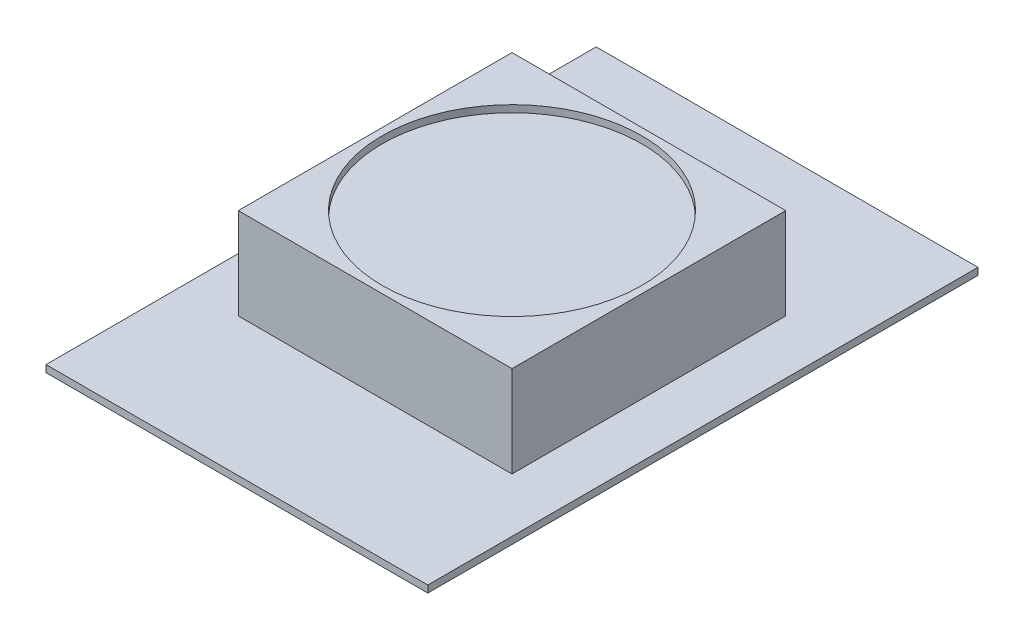
ISO-10303-21;
HEADER;
FILE_DESCRIPTION(('STEP AP214'),'2;1');
FILE_NAME('part.step','',(''),(''),'','','');
FILE_SCHEMA(('AUTOMOTIVE_DESIGN { 1 0 10303 214 1 1 1 1 }'));
ENDSEC;
DATA;
#1=APPLICATION_CONTEXT('core data for automotive mechanical design processes');
#2=APPLICATION_PROTOCOL_DEFINITION('international standard','automotive_design',2000,#1);
#3=PRODUCT_CONTEXT('',#1,'mechanical');
#4=PRODUCT('Part','Part','',(#3));
#5=PRODUCT_RELATED_PRODUCT_CATEGORY('part','',(#4));
#6=PRODUCT_DEFINITION_FORMATION('','',#4);
#7=PRODUCT_DEFINITION_CONTEXT('part definition',#1,'design');
#8=PRODUCT_DEFINITION('design','',#6,#7);
#9=PRODUCT_DEFINITION_SHAPE('','',#8);
#10=(LENGTH_UNIT() NAMED_UNIT(*) SI_UNIT(.MILLI.,.METRE.));
#11=(NAMED_UNIT(*) PLANE_ANGLE_UNIT() SI_UNIT($,.RADIAN.));
#12=(NAMED_UNIT(*) SI_UNIT($,.STERADIAN.) SOLID_ANGLE_UNIT());
#13=UNCERTAINTY_MEASURE_WITH_UNIT(LENGTH_MEASURE(1.E-05),#10,'distance_accuracy_value','');
#14=(GEOMETRIC_REPRESENTATION_CONTEXT(3) GLOBAL_UNCERTAINTY_ASSIGNED_CONTEXT((#13)) GLOBAL_UNIT_ASSIGNED_CONTEXT((#10,
#11,#12)) REPRESENTATION_CONTEXT('',''));
#15=CARTESIAN_POINT('',(0.,0.,0.));
#16=DIRECTION('',(0.,0.,1.));
#17=DIRECTION('',(1.,0.,0.));
#18=AXIS2_PLACEMENT_3D('',#15,#16,#17);
#19=CARTESIAN_POINT('',(0.,0.127,0.));
#20=DIRECTION('',(0.,1.,0.));
#21=DIRECTION('',(0.,0.,1.));
#22=AXIS2_PLACEMENT_3D('',#19,#20,#21);
#23=PLANE('',#22);
#24=DIRECTION('',(0.,0.,1.));
#25=VECTOR('',#24,1.);
#26=CARTESIAN_POINT('',(-3.4544,0.127,-4.9784));
#27=LINE('',#26,#25);
#28=CARTESIAN_POINT('',(-3.4544,0.127,-4.9784));
#29=VERTEX_POINT('',#28);
#30=CARTESIAN_POINT('',(-3.4544,0.127,4.9784));
#31=VERTEX_POINT('',#30);
#32=EDGE_CURVE('E140',#29,#31,#27,.T.);
#33=ORIENTED_EDGE('',*,*,#32,.T.);
#34=DIRECTION('',(1.,0.,0.));
#35=VECTOR('',#34,1.);
#36=CARTESIAN_POINT('',(-3.4544,0.127,4.9784));
#37=LINE('',#36,#35);
#38=CARTESIAN_POINT('',(3.4544,0.127,4.9784));
#39=VERTEX_POINT('',#38);
#40=EDGE_CURVE('E85',#31,#39,#37,.T.);
#41=ORIENTED_EDGE('',*,*,#40,.T.);
#42=DIRECTION('',(0.,0.,-1.));
#43=VECTOR('',#42,1.);
#44=CARTESIAN_POINT('',(3.4544,0.127,-4.9784));
#45=LINE('',#44,#43);
#46=CARTESIAN_POINT('',(3.4544,0.127,-4.9784));
#47=VERTEX_POINT('',#46);
#48=EDGE_CURVE('E143',#39,#47,#45,.T.);
#49=ORIENTED_EDGE('',*,*,#48,.T.);
#50=DIRECTION('',(-1.,0.,0.));
#51=VECTOR('',#50,1.);
#52=CARTESIAN_POINT('',(-3.4544,0.127,-4.9784));
#53=LINE('',#52,#51);
#54=EDGE_CURVE('E57',#47,#29,#53,.T.);
#55=ORIENTED_EDGE('',*,*,#54,.T.);
#56=EDGE_LOOP('',(#33,#41,#49,#55));
#57=FACE_BOUND('',#56,.T.);
#58=DIRECTION('',(1.,0.,0.));
#59=VECTOR('',#58,1.);
#60=CARTESIAN_POINT('',(-2.4765,0.127,2.4765));
#61=LINE('',#60,#59);
#62=CARTESIAN_POINT('',(-2.4765,0.127,2.4765));
#63=VERTEX_POINT('',#62);
#64=CARTESIAN_POINT('',(2.4765,0.127,2.4765));
#65=VERTEX_POINT('',#64);
#66=EDGE_CURVE('E210',#63,#65,#61,.T.);
#67=ORIENTED_EDGE('',*,*,#66,.F.);
#68=DIRECTION('',(0.,0.,1.));
#69=VECTOR('',#68,1.);
#70=CARTESIAN_POINT('',(-2.4765,0.127,-2.4765));
#71=LINE('',#70,#69);
#72=CARTESIAN_POINT('',(-2.4765,0.127,-2.4765));
#73=VERTEX_POINT('',#72);
#74=EDGE_CURVE('E130',#73,#63,#71,.T.);
#75=ORIENTED_EDGE('',*,*,#74,.F.);
#76=DIRECTION('',(-1.,0.,0.));
#77=VECTOR('',#76,1.);
#78=CARTESIAN_POINT('',(-2.4765,0.127,-2.4765));
#79=LINE('',#78,#77);
#80=CARTESIAN_POINT('',(2.4765,0.127,-2.4765));
#81=VERTEX_POINT('',#80);
#82=EDGE_CURVE('E126',#81,#73,#79,.T.);
#83=ORIENTED_EDGE('',*,*,#82,.F.);
#84=DIRECTION('',(0.,0.,-1.));
#85=VECTOR('',#84,1.);
#86=CARTESIAN_POINT('',(2.4765,0.127,-2.4765));
#87=LINE('',#86,#85);
#88=EDGE_CURVE('E219',#65,#81,#87,.T.);
#89=ORIENTED_EDGE('',*,*,#88,.F.);
#90=EDGE_LOOP('',(#67,#75,#83,#89));
#91=FACE_BOUND('',#90,.T.);
#92=ADVANCED_FACE('F33',(#57,#91),#23,.T.);
#93=CARTESIAN_POINT('',(-3.4544,0.127,-4.9784));
#94=DIRECTION('',(1.,0.,0.));
#95=DIRECTION('',(0.,0.,-1.));
#96=AXIS2_PLACEMENT_3D('',#93,#94,#95);
#97=PLANE('',#96);
#98=DIRECTION('',(0.,0.,1.));
#99=VECTOR('',#98,1.);
#100=CARTESIAN_POINT('',(-3.4544,0.,-4.9784));
#101=LINE('',#100,#99);
#102=CARTESIAN_POINT('',(-3.4544,0.,-4.9784));
#103=VERTEX_POINT('',#102);
#104=CARTESIAN_POINT('',(-3.4544,0.,4.9784));
#105=VERTEX_POINT('',#104);
#106=EDGE_CURVE('E132',#103,#105,#101,.T.);
#107=ORIENTED_EDGE('',*,*,#106,.T.);
#108=DIRECTION('',(0.,-1.,0.));
#109=VECTOR('',#108,1.);
#110=CARTESIAN_POINT('',(-3.4544,0.127,4.9784));
#111=LINE('',#110,#109);
#112=EDGE_CURVE('E11',#31,#105,#111,.T.);
#113=ORIENTED_EDGE('',*,*,#112,.F.);
#114=ORIENTED_EDGE('',*,*,#32,.F.);
#115=DIRECTION('',(0.,-1.,0.));
#116=VECTOR('',#115,1.);
#117=CARTESIAN_POINT('',(-3.4544,0.127,-4.9784));
#118=LINE('',#117,#116);
#119=EDGE_CURVE('E145',#29,#103,#118,.T.);
#120=ORIENTED_EDGE('',*,*,#119,.T.);
#121=EDGE_LOOP('',(#107,#113,#114,#120));
#122=FACE_BOUND('',#121,.T.);
#123=ADVANCED_FACE('F35',(#122),#97,.F.);
#124=CARTESIAN_POINT('',(-3.4544,0.127,4.9784));
#125=DIRECTION('',(0.,0.,-1.));
#126=DIRECTION('',(-1.,0.,0.));
#127=AXIS2_PLACEMENT_3D('',#124,#125,#126);
#128=PLANE('',#127);
#129=DIRECTION('',(1.,0.,0.));
#130=VECTOR('',#129,1.);
#131=CARTESIAN_POINT('',(-3.4544,0.,4.9784));
#132=LINE('',#131,#130);
#133=CARTESIAN_POINT('',(3.4544,0.,4.9784));
#134=VERTEX_POINT('',#133);
#135=EDGE_CURVE('E135',#105,#134,#132,.T.);
#136=ORIENTED_EDGE('',*,*,#135,.T.);
#137=DIRECTION('',(0.,-1.,0.));
#138=VECTOR('',#137,1.);
#139=CARTESIAN_POINT('',(3.4544,0.127,4.9784));
#140=LINE('',#139,#138);
#141=EDGE_CURVE('E41',#39,#134,#140,.T.);
#142=ORIENTED_EDGE('',*,*,#141,.F.);
#143=ORIENTED_EDGE('',*,*,#40,.F.);
#144=ORIENTED_EDGE('',*,*,#112,.T.);
#145=EDGE_LOOP('',(#136,#142,#143,#144));
#146=FACE_BOUND('',#145,.T.);
#147=ADVANCED_FACE('F173',(#146),#128,.F.);
#148=CARTESIAN_POINT('',(3.4544,0.127,-4.9784));
#149=DIRECTION('',(-1.,0.,0.));
#150=DIRECTION('',(0.,0.,1.));
#151=AXIS2_PLACEMENT_3D('',#148,#149,#150);
#152=PLANE('',#151);
#153=DIRECTION('',(0.,0.,-1.));
#154=VECTOR('',#153,1.);
#155=CARTESIAN_POINT('',(3.4544,0.,-4.9784));
#156=LINE('',#155,#154);
#157=CARTESIAN_POINT('',(3.4544,0.,-4.9784));
#158=VERTEX_POINT('',#157);
#159=EDGE_CURVE('E148',#134,#158,#156,.T.);
#160=ORIENTED_EDGE('',*,*,#159,.T.);
#161=DIRECTION('',(0.,-1.,0.));
#162=VECTOR('',#161,1.);
#163=CARTESIAN_POINT('',(3.4544,0.127,-4.9784));
#164=LINE('',#163,#162);
#165=EDGE_CURVE('E152',#47,#158,#164,.T.);
#166=ORIENTED_EDGE('',*,*,#165,.F.);
#167=ORIENTED_EDGE('',*,*,#48,.F.);
#168=ORIENTED_EDGE('',*,*,#141,.T.);
#169=EDGE_LOOP('',(#160,#166,#167,#168));
#170=FACE_BOUND('',#169,.T.);
#171=ADVANCED_FACE('F157',(#170),#152,.F.);
#172=CARTESIAN_POINT('',(-3.4544,0.127,-4.9784));
#173=DIRECTION('',(0.,0.,1.));
#174=DIRECTION('',(1.,0.,0.));
#175=AXIS2_PLACEMENT_3D('',#172,#173,#174);
#176=PLANE('',#175);
#177=DIRECTION('',(-1.,0.,0.));
#178=VECTOR('',#177,1.);
#179=CARTESIAN_POINT('',(-3.4544,0.,-4.9784));
#180=LINE('',#179,#178);
#181=EDGE_CURVE('E78',#158,#103,#180,.T.);
#182=ORIENTED_EDGE('',*,*,#181,.T.);
#183=ORIENTED_EDGE('',*,*,#119,.F.);
#184=ORIENTED_EDGE('',*,*,#54,.F.);
#185=ORIENTED_EDGE('',*,*,#165,.T.);
#186=EDGE_LOOP('',(#182,#183,#184,#185));
#187=FACE_BOUND('',#186,.T.);
#188=ADVANCED_FACE('F165',(#187),#176,.F.);
#189=CARTESIAN_POINT('',(0.,0.,0.));
#190=DIRECTION('',(0.,1.,0.));
#191=DIRECTION('',(0.,0.,1.));
#192=AXIS2_PLACEMENT_3D('',#189,#190,#191);
#193=PLANE('',#192);
#194=ORIENTED_EDGE('',*,*,#106,.F.);
#195=ORIENTED_EDGE('',*,*,#181,.F.);
#196=ORIENTED_EDGE('',*,*,#159,.F.);
#197=ORIENTED_EDGE('',*,*,#135,.F.);
#198=EDGE_LOOP('',(#194,#195,#196,#197));
#199=FACE_BOUND('',#198,.T.);
#200=ADVANCED_FACE('F161',(#199),#193,.F.);
#201=CARTESIAN_POINT('',(-2.4765,1.778,-2.4765));
#202=DIRECTION('',(1.,0.,0.));
#203=DIRECTION('',(0.,0.,-1.));
#204=AXIS2_PLACEMENT_3D('',#201,#202,#203);
#205=PLANE('',#204);
#206=ORIENTED_EDGE('',*,*,#74,.T.);
#207=DIRECTION('',(0.,-1.,0.));
#208=VECTOR('',#207,1.);
#209=CARTESIAN_POINT('',(-2.4765,1.778,2.4765));
#210=LINE('',#209,#208);
#211=CARTESIAN_POINT('',(-2.4765,1.778,2.4765));
#212=VERTEX_POINT('',#211);
#213=EDGE_CURVE('E111',#212,#63,#210,.T.);
#214=ORIENTED_EDGE('',*,*,#213,.F.);
#215=DIRECTION('',(0.,0.,1.));
#216=VECTOR('',#215,1.);
#217=CARTESIAN_POINT('',(-2.4765,1.778,-2.4765));
#218=LINE('',#217,#216);
#219=CARTESIAN_POINT('',(-2.4765,1.778,-2.4765));
#220=VERTEX_POINT('',#219);
#221=EDGE_CURVE('E118',#220,#212,#218,.T.);
#222=ORIENTED_EDGE('',*,*,#221,.F.);
#223=DIRECTION('',(0.,-1.,0.));
#224=VECTOR('',#223,1.);
#225=CARTESIAN_POINT('',(-2.4765,1.778,-2.4765));
#226=LINE('',#225,#224);
#227=EDGE_CURVE('E216',#220,#73,#226,.T.);
#228=ORIENTED_EDGE('',*,*,#227,.T.);
#229=EDGE_LOOP('',(#206,#214,#222,#228));
#230=FACE_BOUND('',#229,.T.);
#231=ADVANCED_FACE('F128',(#230),#205,.F.);
#232=CARTESIAN_POINT('',(-2.4765,1.778,2.4765));
#233=DIRECTION('',(0.,0.,-1.));
#234=DIRECTION('',(-1.,0.,0.));
#235=AXIS2_PLACEMENT_3D('',#232,#233,#234);
#236=PLANE('',#235);
#237=ORIENTED_EDGE('',*,*,#66,.T.);
#238=DIRECTION('',(0.,-1.,0.));
#239=VECTOR('',#238,1.);
#240=CARTESIAN_POINT('',(2.4765,1.778,2.4765));
#241=LINE('',#240,#239);
#242=CARTESIAN_POINT('',(2.4765,1.778,2.4765));
#243=VERTEX_POINT('',#242);
#244=EDGE_CURVE('E114',#243,#65,#241,.T.);
#245=ORIENTED_EDGE('',*,*,#244,.F.);
#246=DIRECTION('',(1.,0.,0.));
#247=VECTOR('',#246,1.);
#248=CARTESIAN_POINT('',(-2.4765,1.778,2.4765));
#249=LINE('',#248,#247);
#250=EDGE_CURVE('E107',#212,#243,#249,.T.);
#251=ORIENTED_EDGE('',*,*,#250,.F.);
#252=ORIENTED_EDGE('',*,*,#213,.T.);
#253=EDGE_LOOP('',(#237,#245,#251,#252));
#254=FACE_BOUND('',#253,.T.);
#255=ADVANCED_FACE('F109',(#254),#236,.F.);
#256=CARTESIAN_POINT('',(2.4765,1.778,-2.4765));
#257=DIRECTION('',(-1.,0.,0.));
#258=DIRECTION('',(0.,0.,1.));
#259=AXIS2_PLACEMENT_3D('',#256,#257,#258);
#260=PLANE('',#259);
#261=ORIENTED_EDGE('',*,*,#88,.T.);
#262=DIRECTION('',(0.,-1.,0.));
#263=VECTOR('',#262,1.);
#264=CARTESIAN_POINT('',(2.4765,1.778,-2.4765));
#265=LINE('',#264,#263);
#266=CARTESIAN_POINT('',(2.4765,1.778,-2.4765));
#267=VERTEX_POINT('',#266);
#268=EDGE_CURVE('E48',#267,#81,#265,.T.);
#269=ORIENTED_EDGE('',*,*,#268,.F.);
#270=DIRECTION('',(0.,0.,-1.));
#271=VECTOR('',#270,1.);
#272=CARTESIAN_POINT('',(2.4765,1.778,-2.4765));
#273=LINE('',#272,#271);
#274=EDGE_CURVE('E117',#243,#267,#273,.T.);
#275=ORIENTED_EDGE('',*,*,#274,.F.);
#276=ORIENTED_EDGE('',*,*,#244,.T.);
#277=EDGE_LOOP('',(#261,#269,#275,#276));
#278=FACE_BOUND('',#277,.T.);
#279=ADVANCED_FACE('F186',(#278),#260,.F.);
#280=CARTESIAN_POINT('',(-2.4765,1.778,-2.4765));
#281=DIRECTION('',(0.,0.,1.));
#282=DIRECTION('',(1.,0.,0.));
#283=AXIS2_PLACEMENT_3D('',#280,#281,#282);
#284=PLANE('',#283);
#285=ORIENTED_EDGE('',*,*,#82,.T.);
#286=ORIENTED_EDGE('',*,*,#227,.F.);
#287=DIRECTION('',(-1.,0.,0.));
#288=VECTOR('',#287,1.);
#289=CARTESIAN_POINT('',(-2.4765,1.778,-2.4765));
#290=LINE('',#289,#288);
#291=EDGE_CURVE('E122',#267,#220,#290,.T.);
#292=ORIENTED_EDGE('',*,*,#291,.F.);
#293=ORIENTED_EDGE('',*,*,#268,.T.);
#294=EDGE_LOOP('',(#285,#286,#292,#293));
#295=FACE_BOUND('',#294,.T.);
#296=ADVANCED_FACE('F189',(#295),#284,.F.);
#297=CARTESIAN_POINT('',(0.,1.778,0.));
#298=DIRECTION('',(0.,1.,0.));
#299=DIRECTION('',(0.,0.,1.));
#300=AXIS2_PLACEMENT_3D('',#297,#298,#299);
#301=PLANE('',#300);
#302=CARTESIAN_POINT('',(0.,1.778,0.));
#303=DIRECTION('',(0.,1.,0.));
#304=DIRECTION('',(0.,0.,1.));
#305=AXIS2_PLACEMENT_3D('',#302,#303,#304);
#306=CIRCLE('',#305,2.34834557241832);
#307=CARTESIAN_POINT('',(0.,1.778,2.34834557241832));
#308=VERTEX_POINT('',#307);
#309=EDGE_CURVE('E208',#308,#308,#306,.T.);
#310=ORIENTED_EDGE('',*,*,#309,.F.);
#311=EDGE_LOOP('',(#310));
#312=FACE_BOUND('',#311,.T.);
#313=ORIENTED_EDGE('',*,*,#221,.T.);
#314=ORIENTED_EDGE('',*,*,#250,.T.);
#315=ORIENTED_EDGE('',*,*,#274,.T.);
#316=ORIENTED_EDGE('',*,*,#291,.T.);
#317=EDGE_LOOP('',(#313,#314,#315,#316));
#318=FACE_BOUND('',#317,.T.);
#319=ADVANCED_FACE('F121',(#312,#318),#301,.T.);
#320=CARTESIAN_POINT('',(0.,1.651,0.));
#321=DIRECTION('',(0.,1.,0.));
#322=DIRECTION('',(0.,0.,1.));
#323=AXIS2_PLACEMENT_3D('',#320,#321,#322);
#324=CYLINDRICAL_SURFACE('',#323,2.34834557241832);
#325=CARTESIAN_POINT('',(0.,1.651,0.));
#326=DIRECTION('',(0.,1.,0.));
#327=DIRECTION('',(0.,0.,1.));
#328=AXIS2_PLACEMENT_3D('',#325,#326,#327);
#329=CIRCLE('',#328,2.34834557241832);
#330=CARTESIAN_POINT('',(0.,1.651,2.34834557241832));
#331=VERTEX_POINT('',#330);
#332=EDGE_CURVE('E207',#331,#331,#329,.T.);
#333=ORIENTED_EDGE('',*,*,#332,.F.);
#334=EDGE_LOOP('',(#333));
#335=FACE_BOUND('',#334,.T.);
#336=ORIENTED_EDGE('',*,*,#309,.T.);
#337=EDGE_LOOP('',(#336));
#338=FACE_BOUND('',#337,.T.);
#339=ADVANCED_FACE('F195',(#335,#338),#324,.F.);
#340=CARTESIAN_POINT('',(0.,1.651,0.));
#341=DIRECTION('',(0.,1.,0.));
#342=DIRECTION('',(0.,0.,1.));
#343=AXIS2_PLACEMENT_3D('',#340,#341,#342);
#344=PLANE('',#343);
#345=ORIENTED_EDGE('',*,*,#332,.T.);
#346=EDGE_LOOP('',(#345));
#347=FACE_BOUND('',#346,.T.);
#348=ADVANCED_FACE('F199',(#347),#344,.T.);
#349=CLOSED_SHELL('',(#92,#123,#147,#171,#188,#200,#231,#255,#279,#296,#319,#339,#348));
#350=MANIFOLD_SOLID_BREP('B2',#349);
#351=ADVANCED_BREP_SHAPE_REPRESENTATION('',(#18,#350),#14);
#352=SHAPE_DEFINITION_REPRESENTATION(#9,#351);
ENDSEC;
END-ISO-10303-21;
